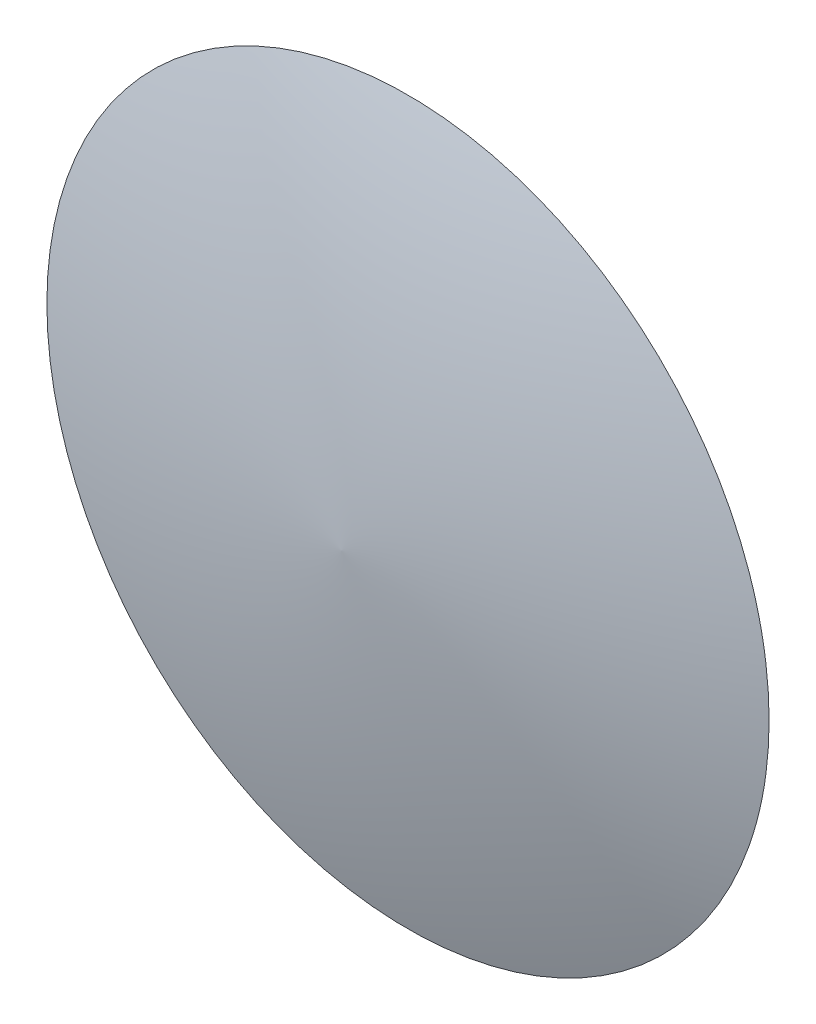
ISO-10303-21;
HEADER;
FILE_DESCRIPTION(('STEP AP214'),'2;1');
FILE_NAME('part.step','',(''),(''),'','','');
FILE_SCHEMA(('AUTOMOTIVE_DESIGN { 1 0 10303 214 1 1 1 1 }'));
ENDSEC;
DATA;
#1=APPLICATION_CONTEXT('core data for automotive mechanical design processes');
#2=APPLICATION_PROTOCOL_DEFINITION('international standard','automotive_design',2000,#1);
#3=PRODUCT_CONTEXT('',#1,'mechanical');
#4=PRODUCT('Part','Part','',(#3));
#5=PRODUCT_RELATED_PRODUCT_CATEGORY('part','',(#4));
#6=PRODUCT_DEFINITION_FORMATION('','',#4);
#7=PRODUCT_DEFINITION_CONTEXT('part definition',#1,'design');
#8=PRODUCT_DEFINITION('design','',#6,#7);
#9=PRODUCT_DEFINITION_SHAPE('','',#8);
#10=(LENGTH_UNIT() NAMED_UNIT(*) SI_UNIT(.MILLI.,.METRE.));
#11=(NAMED_UNIT(*) PLANE_ANGLE_UNIT() SI_UNIT($,.RADIAN.));
#12=(NAMED_UNIT(*) SI_UNIT($,.STERADIAN.) SOLID_ANGLE_UNIT());
#13=UNCERTAINTY_MEASURE_WITH_UNIT(LENGTH_MEASURE(1.E-05),#10,'distance_accuracy_value','');
#14=(GEOMETRIC_REPRESENTATION_CONTEXT(3) GLOBAL_UNCERTAINTY_ASSIGNED_CONTEXT((#13)) GLOBAL_UNIT_ASSIGNED_CONTEXT((#10,
#11,#12)) REPRESENTATION_CONTEXT('',''));
#15=CARTESIAN_POINT('',(0.,0.,0.));
#16=DIRECTION('',(0.,0.,1.));
#17=DIRECTION('',(1.,0.,0.));
#18=AXIS2_PLACEMENT_3D('',#15,#16,#17);
#19=CARTESIAN_POINT('',(1.5,0.,6.25));
#20=DIRECTION('',(0.,0.,-1.));
#21=DIRECTION('',(0.,-1.,0.));
#22=AXIS2_PLACEMENT_3D('',#19,#20,#21);
#23=PLANE('',#22);
#24=CARTESIAN_POINT('',(0.,0.,6.25));
#25=DIRECTION('',(0.,0.,1.));
#26=DIRECTION('',(1.,0.,0.));
#27=AXIS2_PLACEMENT_3D('',#24,#25,#26);
#28=CIRCLE('',#27,1.5);
#29=CARTESIAN_POINT('',(-1.5,0.,6.25));
#30=VERTEX_POINT('',#29);
#31=EDGE_CURVE('E11',#30,#30,#28,.T.);
#32=ORIENTED_EDGE('',*,*,#31,.F.);
#33=EDGE_LOOP('',(#32));
#34=FACE_BOUND('',#33,.T.);
#35=ADVANCED_FACE('F16',(#34),#23,.T.);
#36=CARTESIAN_POINT('',(0.,0.,6.52634947283108));
#37=CARTESIAN_POINT('',(0.,0.,6.52634947283108));
#38=CARTESIAN_POINT('',(0.,0.,6.52634947283108));
#39=CARTESIAN_POINT('',(0.,0.,6.52634947283108));
#40=CARTESIAN_POINT('',(0.,0.,6.52634947283108));
#41=CARTESIAN_POINT('',(0.,0.,6.52634947283108));
#42=CARTESIAN_POINT('',(0.,0.,6.52634947283108));
#43=CARTESIAN_POINT('',(0.510358772278877,0.,6.49799630961544));
#44=CARTESIAN_POINT('',(0.510358772278877,1.02071754455775,6.49799630961544));
#45=CARTESIAN_POINT('',(-0.510358772278877,1.02071754455775,6.49799630961544));
#46=CARTESIAN_POINT('',(-0.510358772278877,0.,6.49799630961544));
#47=CARTESIAN_POINT('',(-0.510358772278877,-1.02071754455775,6.49799630961544));
#48=CARTESIAN_POINT('',(0.510358772278877,-1.02071754455775,6.49799630961544));
#49=CARTESIAN_POINT('',(0.510358772278877,0.,6.49799630961544));
#50=CARTESIAN_POINT('',(1.01304467923183,0.,6.40538498602473));
#51=CARTESIAN_POINT('',(1.01304467923183,2.02608935846366,6.40538498602473));
#52=CARTESIAN_POINT('',(-1.01304467923183,2.02608935846366,6.40538498602473));
#53=CARTESIAN_POINT('',(-1.01304467923183,0.,6.40538498602473));
#54=CARTESIAN_POINT('',(-1.01304467923183,-2.02608935846366,6.40538498602473));
#55=CARTESIAN_POINT('',(1.01304467923183,-2.02608935846366,6.40538498602473));
#56=CARTESIAN_POINT('',(1.01304467923183,0.,6.40538498602473));
#57=CARTESIAN_POINT('',(1.5,0.,6.25));
#58=CARTESIAN_POINT('',(1.5,3.,6.25));
#59=CARTESIAN_POINT('',(-1.5,3.,6.25));
#60=CARTESIAN_POINT('',(-1.5,0.,6.25));
#61=CARTESIAN_POINT('',(-1.5,-3.,6.25));
#62=CARTESIAN_POINT('',(1.5,-3.,6.25));
#63=CARTESIAN_POINT('',(1.5,0.,6.25));
#64=(BOUNDED_SURFACE() B_SPLINE_SURFACE(3,3,((#36,#37,#38,#39,#40,#41,#42),(#43,#44,#45,#46,#47,
#48,#49),(#50,#51,#52,#53,#54,#55,#56),(#57,#58,#59,#60,#61,#62,#63)),.UNSPECIFIED.,.F.,.T.,
.F.) B_SPLINE_SURFACE_WITH_KNOTS((4,4),(4,3,4),(0.,6.28318530717959),(1.26191457503105,
1.38860629782538,1.51529802061971),
.UNSPECIFIED.) GEOMETRIC_REPRESENTATION_ITEM() RATIONAL_B_SPLINE_SURFACE(((1.,0.333333333333333,
0.333333333333333,1.,0.333333333333333,0.333333333333333,1.),(0.994656888295846,
0.331552296098615,0.331552296098615,0.994656888295846,0.331552296098615,0.331552296098615,
0.994656888295846),(0.994656888295846,0.331552296098615,0.331552296098615,0.994656888295846,
0.331552296098615,0.331552296098615,0.994656888295846),(1.,0.333333333333333,0.333333333333333,
1.,0.333333333333333,0.333333333333333,1.))) REPRESENTATION_ITEM('') SURFACE());
#65=CARTESIAN_POINT('',(0.334795989563804,0.,0.5));
#66=DIRECTION('',(0.,-1.,0.));
#67=DIRECTION('',(-1.,0.,0.));
#68=AXIS2_PLACEMENT_3D('',#65,#66,#67);
#69=CIRCLE('',#68,6.03564216329293);
#70=CARTESIAN_POINT('',(0.,0.,6.52634947283108));
#71=VERTEX_POINT('',#70);
#72=EDGE_CURVE('E22',#71,#30,#69,.T.);
#73=ORIENTED_EDGE('',*,*,#72,.T.);
#74=ORIENTED_EDGE('',*,*,#31,.T.);
#75=ORIENTED_EDGE('',*,*,#72,.F.);
#76=EDGE_LOOP('',(#73,#74,#75));
#77=FACE_BOUND('',#76,.T.);
#78=ADVANCED_FACE('F18',(#77),#64,.T.);
#79=CLOSED_SHELL('',(#35,#78));
#80=MANIFOLD_SOLID_BREP('B1',#79);
#81=ADVANCED_BREP_SHAPE_REPRESENTATION('',(#18,#80),#14);
#82=SHAPE_DEFINITION_REPRESENTATION(#9,#81);
ENDSEC;
END-ISO-10303-21;
